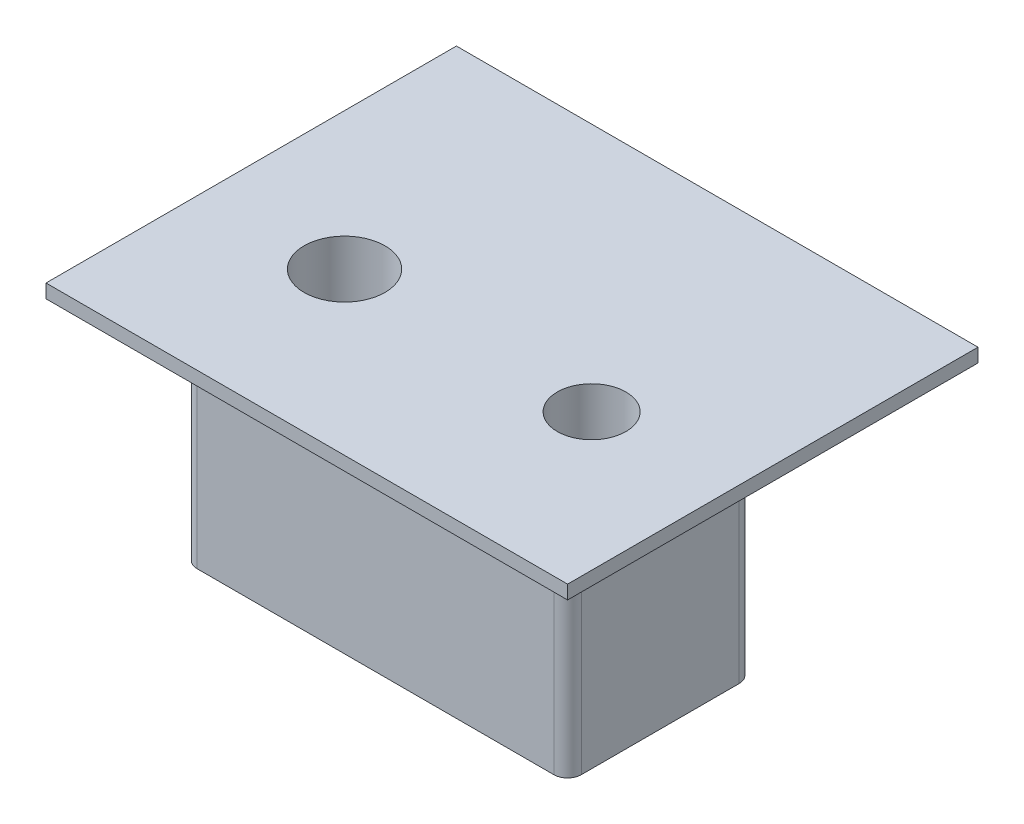
ISO-10303-21;
HEADER;
FILE_DESCRIPTION(('STEP AP214'),'2;1');
FILE_NAME('part.step','',(''),(''),'','','');
FILE_SCHEMA(('AUTOMOTIVE_DESIGN { 1 0 10303 214 1 1 1 1 }'));
ENDSEC;
DATA;
#1=APPLICATION_CONTEXT('core data for automotive mechanical design processes');
#2=APPLICATION_PROTOCOL_DEFINITION('international standard','automotive_design',2000,#1);
#3=PRODUCT_CONTEXT('',#1,'mechanical');
#4=PRODUCT('Part','Part','',(#3));
#5=PRODUCT_RELATED_PRODUCT_CATEGORY('part','',(#4));
#6=PRODUCT_DEFINITION_FORMATION('','',#4);
#7=PRODUCT_DEFINITION_CONTEXT('part definition',#1,'design');
#8=PRODUCT_DEFINITION('design','',#6,#7);
#9=PRODUCT_DEFINITION_SHAPE('','',#8);
#10=(LENGTH_UNIT() NAMED_UNIT(*) SI_UNIT(.MILLI.,.METRE.));
#11=(NAMED_UNIT(*) PLANE_ANGLE_UNIT() SI_UNIT($,.RADIAN.));
#12=(NAMED_UNIT(*) SI_UNIT($,.STERADIAN.) SOLID_ANGLE_UNIT());
#13=UNCERTAINTY_MEASURE_WITH_UNIT(LENGTH_MEASURE(1.E-05),#10,'distance_accuracy_value','');
#14=(GEOMETRIC_REPRESENTATION_CONTEXT(3) GLOBAL_UNCERTAINTY_ASSIGNED_CONTEXT((#13)) GLOBAL_UNIT_ASSIGNED_CONTEXT((#10,
#11,#12)) REPRESENTATION_CONTEXT('',''));
#15=CARTESIAN_POINT('',(0.,0.,0.));
#16=DIRECTION('',(0.,0.,1.));
#17=DIRECTION('',(1.,0.,0.));
#18=AXIS2_PLACEMENT_3D('',#15,#16,#17);
#19=CARTESIAN_POINT('',(-7.,185.,3.375));
#20=DIRECTION('',(0.,1.,0.));
#21=DIRECTION('',(0.,0.,1.));
#22=AXIS2_PLACEMENT_3D('',#19,#20,#21);
#23=PLANE('',#22);
#24=DIRECTION('',(1.,0.,0.));
#25=VECTOR('',#24,1.);
#26=CARTESIAN_POINT('',(-7.,185.,-3.375));
#27=LINE('',#26,#25);
#28=CARTESIAN_POINT('',(-6.5,185.,-3.375));
#29=VERTEX_POINT('',#28);
#30=CARTESIAN_POINT('',(6.5,185.,-3.375));
#31=VERTEX_POINT('',#30);
#32=EDGE_CURVE('E170',#29,#31,#27,.T.);
#33=ORIENTED_EDGE('',*,*,#32,.T.);
#34=CARTESIAN_POINT('',(6.5,185.,-2.875));
#35=DIRECTION('',(0.,1.,0.));
#36=DIRECTION('',(0.,0.,1.));
#37=AXIS2_PLACEMENT_3D('',#34,#35,#36);
#38=CIRCLE('',#37,0.5);
#39=CARTESIAN_POINT('',(7.,185.,-2.875));
#40=VERTEX_POINT('',#39);
#41=EDGE_CURVE('E211',#31,#40,#38,.F.);
#42=ORIENTED_EDGE('',*,*,#41,.T.);
#43=DIRECTION('',(0.,0.,-1.));
#44=VECTOR('',#43,1.);
#45=CARTESIAN_POINT('',(7.,185.,3.375));
#46=LINE('',#45,#44);
#47=CARTESIAN_POINT('',(7.,185.,2.875));
#48=VERTEX_POINT('',#47);
#49=EDGE_CURVE('E186',#48,#40,#46,.T.);
#50=ORIENTED_EDGE('',*,*,#49,.F.);
#51=CARTESIAN_POINT('',(6.5,185.,2.875));
#52=DIRECTION('',(0.,1.,0.));
#53=DIRECTION('',(0.,0.,1.));
#54=AXIS2_PLACEMENT_3D('',#51,#52,#53);
#55=CIRCLE('',#54,0.5);
#56=CARTESIAN_POINT('',(6.5,185.,3.375));
#57=VERTEX_POINT('',#56);
#58=EDGE_CURVE('E209',#48,#57,#55,.F.);
#59=ORIENTED_EDGE('',*,*,#58,.T.);
#60=DIRECTION('',(1.,0.,0.));
#61=VECTOR('',#60,1.);
#62=CARTESIAN_POINT('',(-7.,185.,3.375));
#63=LINE('',#62,#61);
#64=CARTESIAN_POINT('',(-6.5,185.,3.375));
#65=VERTEX_POINT('',#64);
#66=EDGE_CURVE('E171',#65,#57,#63,.T.);
#67=ORIENTED_EDGE('',*,*,#66,.F.);
#68=CARTESIAN_POINT('',(-6.5,185.,2.875));
#69=DIRECTION('',(0.,1.,0.));
#70=DIRECTION('',(0.,0.,1.));
#71=AXIS2_PLACEMENT_3D('',#68,#69,#70);
#72=CIRCLE('',#71,0.5);
#73=CARTESIAN_POINT('',(-7.,185.,2.875));
#74=VERTEX_POINT('',#73);
#75=EDGE_CURVE('E205',#65,#74,#72,.F.);
#76=ORIENTED_EDGE('',*,*,#75,.T.);
#77=DIRECTION('',(0.,0.,-1.));
#78=VECTOR('',#77,1.);
#79=CARTESIAN_POINT('',(-7.,185.,3.375));
#80=LINE('',#79,#78);
#81=CARTESIAN_POINT('',(-7.,185.,-2.875));
#82=VERTEX_POINT('',#81);
#83=EDGE_CURVE('E189',#74,#82,#80,.T.);
#84=ORIENTED_EDGE('',*,*,#83,.T.);
#85=CARTESIAN_POINT('',(-6.5,185.,-2.875));
#86=DIRECTION('',(0.,1.,0.));
#87=DIRECTION('',(0.,0.,1.));
#88=AXIS2_PLACEMENT_3D('',#85,#86,#87);
#89=CIRCLE('',#88,0.5);
#90=EDGE_CURVE('E207',#82,#29,#89,.F.);
#91=ORIENTED_EDGE('',*,*,#90,.T.);
#92=EDGE_LOOP('',(#33,#42,#50,#59,#67,#76,#84,#91));
#93=FACE_BOUND('',#92,.T.);
#94=CARTESIAN_POINT('',(-4.49999999999999,185.,0.));
#95=DIRECTION('',(0.,1.,0.));
#96=DIRECTION('',(0.,0.,1.));
#97=AXIS2_PLACEMENT_3D('',#94,#95,#96);
#98=CIRCLE('',#97,1.4732);
#99=CARTESIAN_POINT('',(-4.49999999999999,185.,1.4732));
#100=VERTEX_POINT('',#99);
#101=EDGE_CURVE('E132',#100,#100,#98,.T.);
#102=ORIENTED_EDGE('',*,*,#101,.T.);
#103=EDGE_LOOP('',(#102));
#104=FACE_BOUND('',#103,.T.);
#105=CARTESIAN_POINT('',(4.5,185.,0.));
#106=DIRECTION('',(0.,1.,0.));
#107=DIRECTION('',(0.,0.,1.));
#108=AXIS2_PLACEMENT_3D('',#105,#106,#107);
#109=CIRCLE('',#108,1.25);
#110=CARTESIAN_POINT('',(4.5,185.,1.25));
#111=VERTEX_POINT('',#110);
#112=EDGE_CURVE('E151',#111,#111,#109,.F.);
#113=ORIENTED_EDGE('',*,*,#112,.F.);
#114=EDGE_LOOP('',(#113));
#115=FACE_BOUND('',#114,.T.);
#116=ADVANCED_FACE('F31',(#93,#104,#115),#23,.F.);
#117=CARTESIAN_POINT('',(9.5,193.7625,-5.875));
#118=DIRECTION('',(0.,1.,0.));
#119=DIRECTION('',(0.,0.,1.));
#120=AXIS2_PLACEMENT_3D('',#117,#118,#119);
#121=PLANE('',#120);
#122=DIRECTION('',(0.,0.,-1.));
#123=VECTOR('',#122,1.);
#124=CARTESIAN_POINT('',(9.5,193.7625,5.875));
#125=LINE('',#124,#123);
#126=CARTESIAN_POINT('',(9.5,193.7625,5.875));
#127=VERTEX_POINT('',#126);
#128=CARTESIAN_POINT('',(9.5,193.7625,-9.075));
#129=VERTEX_POINT('',#128);
#130=EDGE_CURVE('E157',#127,#129,#125,.T.);
#131=ORIENTED_EDGE('',*,*,#130,.T.);
#132=DIRECTION('',(1.,0.,0.));
#133=VECTOR('',#132,1.);
#134=CARTESIAN_POINT('',(-9.5,193.7625,-9.075));
#135=LINE('',#134,#133);
#136=CARTESIAN_POINT('',(-9.5,193.7625,-9.075));
#137=VERTEX_POINT('',#136);
#138=EDGE_CURVE('E145',#137,#129,#135,.T.);
#139=ORIENTED_EDGE('',*,*,#138,.F.);
#140=DIRECTION('',(0.,0.,1.));
#141=VECTOR('',#140,1.);
#142=CARTESIAN_POINT('',(-9.5,193.7625,-5.875));
#143=LINE('',#142,#141);
#144=CARTESIAN_POINT('',(-9.5,193.7625,5.875));
#145=VERTEX_POINT('',#144);
#146=EDGE_CURVE('E159',#137,#145,#143,.T.);
#147=ORIENTED_EDGE('',*,*,#146,.T.);
#148=DIRECTION('',(1.,0.,0.));
#149=VECTOR('',#148,1.);
#150=CARTESIAN_POINT('',(-9.5,193.7625,5.875));
#151=LINE('',#150,#149);
#152=EDGE_CURVE('E162',#145,#127,#151,.T.);
#153=ORIENTED_EDGE('',*,*,#152,.T.);
#154=EDGE_LOOP('',(#131,#139,#147,#153));
#155=FACE_BOUND('',#154,.T.);
#156=CARTESIAN_POINT('',(-4.49999999999999,193.7625,0.));
#157=DIRECTION('',(0.,1.,0.));
#158=DIRECTION('',(0.,0.,1.));
#159=AXIS2_PLACEMENT_3D('',#156,#157,#158);
#160=CIRCLE('',#159,1.4732);
#161=CARTESIAN_POINT('',(-4.49999999999999,193.7625,1.4732));
#162=VERTEX_POINT('',#161);
#163=EDGE_CURVE('E154',#162,#162,#160,.T.);
#164=ORIENTED_EDGE('',*,*,#163,.F.);
#165=EDGE_LOOP('',(#164));
#166=FACE_BOUND('',#165,.T.);
#167=CARTESIAN_POINT('',(4.5,193.7625,0.));
#168=DIRECTION('',(0.,1.,0.));
#169=DIRECTION('',(0.,0.,1.));
#170=AXIS2_PLACEMENT_3D('',#167,#168,#169);
#171=CIRCLE('',#170,1.25);
#172=CARTESIAN_POINT('',(4.5,193.7625,1.25));
#173=VERTEX_POINT('',#172);
#174=EDGE_CURVE('E150',#173,#173,#171,.F.);
#175=ORIENTED_EDGE('',*,*,#174,.T.);
#176=EDGE_LOOP('',(#175));
#177=FACE_BOUND('',#176,.T.);
#178=ADVANCED_FACE('F271',(#155,#166,#177),#121,.T.);
#179=CARTESIAN_POINT('',(-7.,193.2625,3.375));
#180=DIRECTION('',(1.,0.,0.));
#181=DIRECTION('',(0.,1.,0.));
#182=AXIS2_PLACEMENT_3D('',#179,#180,#181);
#183=PLANE('',#182);
#184=DIRECTION('',(0.,0.,-1.));
#185=VECTOR('',#184,1.);
#186=CARTESIAN_POINT('',(-7.,193.2625,3.375));
#187=LINE('',#186,#185);
#188=CARTESIAN_POINT('',(-7.,193.2625,2.875));
#189=VERTEX_POINT('',#188);
#190=CARTESIAN_POINT('',(-7.,193.2625,-2.875));
#191=VERTEX_POINT('',#190);
#192=EDGE_CURVE('E178',#189,#191,#187,.T.);
#193=ORIENTED_EDGE('',*,*,#192,.T.);
#194=DIRECTION('',(0.,-1.,0.));
#195=VECTOR('',#194,1.);
#196=CARTESIAN_POINT('',(-7.,193.2625,-2.875));
#197=LINE('',#196,#195);
#198=EDGE_CURVE('E220',#191,#82,#197,.T.);
#199=ORIENTED_EDGE('',*,*,#198,.T.);
#200=ORIENTED_EDGE('',*,*,#83,.F.);
#201=DIRECTION('',(0.,-1.,0.));
#202=VECTOR('',#201,1.);
#203=CARTESIAN_POINT('',(-7.,193.2625,2.875));
#204=LINE('',#203,#202);
#205=EDGE_CURVE('E52',#74,#189,#204,.F.);
#206=ORIENTED_EDGE('',*,*,#205,.T.);
#207=EDGE_LOOP('',(#193,#199,#200,#206));
#208=FACE_BOUND('',#207,.T.);
#209=ADVANCED_FACE('F245',(#208),#183,.F.);
#210=CARTESIAN_POINT('',(7.,193.2625,3.375));
#211=DIRECTION('',(-1.,0.,0.));
#212=DIRECTION('',(0.,-1.,0.));
#213=AXIS2_PLACEMENT_3D('',#210,#211,#212);
#214=PLANE('',#213);
#215=ORIENTED_EDGE('',*,*,#49,.T.);
#216=DIRECTION('',(0.,1.,0.));
#217=VECTOR('',#216,1.);
#218=CARTESIAN_POINT('',(7.,193.2625,-2.875));
#219=LINE('',#218,#217);
#220=CARTESIAN_POINT('',(7.,193.2625,-2.875));
#221=VERTEX_POINT('',#220);
#222=EDGE_CURVE('E198',#40,#221,#219,.T.);
#223=ORIENTED_EDGE('',*,*,#222,.T.);
#224=DIRECTION('',(0.,0.,-1.));
#225=VECTOR('',#224,1.);
#226=CARTESIAN_POINT('',(7.,193.2625,3.375));
#227=LINE('',#226,#225);
#228=CARTESIAN_POINT('',(7.,193.2625,2.875));
#229=VERTEX_POINT('',#228);
#230=EDGE_CURVE('E183',#229,#221,#227,.T.);
#231=ORIENTED_EDGE('',*,*,#230,.F.);
#232=DIRECTION('',(0.,1.,0.));
#233=VECTOR('',#232,1.);
#234=CARTESIAN_POINT('',(7.,185.,2.875));
#235=LINE('',#234,#233);
#236=EDGE_CURVE('E192',#229,#48,#235,.F.);
#237=ORIENTED_EDGE('',*,*,#236,.T.);
#238=EDGE_LOOP('',(#215,#223,#231,#237));
#239=FACE_BOUND('',#238,.T.);
#240=ADVANCED_FACE('F232',(#239),#214,.F.);
#241=CARTESIAN_POINT('',(-7.,185.,3.375));
#242=DIRECTION('',(0.,0.,1.));
#243=DIRECTION('',(1.,0.,0.));
#244=AXIS2_PLACEMENT_3D('',#241,#242,#243);
#245=PLANE('',#244);
#246=ORIENTED_EDGE('',*,*,#66,.T.);
#247=DIRECTION('',(0.,1.,0.));
#248=VECTOR('',#247,1.);
#249=CARTESIAN_POINT('',(6.5,193.2625,3.375));
#250=LINE('',#249,#248);
#251=CARTESIAN_POINT('',(6.5,193.2625,3.375));
#252=VERTEX_POINT('',#251);
#253=EDGE_CURVE('E216',#57,#252,#250,.T.);
#254=ORIENTED_EDGE('',*,*,#253,.T.);
#255=DIRECTION('',(-1.,0.,0.));
#256=VECTOR('',#255,1.);
#257=CARTESIAN_POINT('',(-7.,193.2625,3.375));
#258=LINE('',#257,#256);
#259=CARTESIAN_POINT('',(-6.5,193.2625,3.375));
#260=VERTEX_POINT('',#259);
#261=EDGE_CURVE('E174',#252,#260,#258,.T.);
#262=ORIENTED_EDGE('',*,*,#261,.T.);
#263=DIRECTION('',(0.,-1.,0.));
#264=VECTOR('',#263,1.);
#265=CARTESIAN_POINT('',(-6.5,185.,3.375));
#266=LINE('',#265,#264);
#267=EDGE_CURVE('E213',#260,#65,#266,.T.);
#268=ORIENTED_EDGE('',*,*,#267,.T.);
#269=EDGE_LOOP('',(#246,#254,#262,#268));
#270=FACE_BOUND('',#269,.T.);
#271=ADVANCED_FACE('F241',(#270),#245,.T.);
#272=CARTESIAN_POINT('',(-7.,185.,-3.375));
#273=DIRECTION('',(0.,0.,1.));
#274=DIRECTION('',(1.,0.,0.));
#275=AXIS2_PLACEMENT_3D('',#272,#273,#274);
#276=PLANE('',#275);
#277=DIRECTION('',(-1.,0.,0.));
#278=VECTOR('',#277,1.);
#279=CARTESIAN_POINT('',(-7.,193.2625,-3.375));
#280=LINE('',#279,#278);
#281=CARTESIAN_POINT('',(6.5,193.2625,-3.375));
#282=VERTEX_POINT('',#281);
#283=CARTESIAN_POINT('',(-6.5,193.2625,-3.375));
#284=VERTEX_POINT('',#283);
#285=EDGE_CURVE('E175',#282,#284,#280,.T.);
#286=ORIENTED_EDGE('',*,*,#285,.F.);
#287=DIRECTION('',(0.,1.,0.));
#288=VECTOR('',#287,1.);
#289=CARTESIAN_POINT('',(6.5,185.,-3.375));
#290=LINE('',#289,#288);
#291=EDGE_CURVE('E203',#282,#31,#290,.F.);
#292=ORIENTED_EDGE('',*,*,#291,.T.);
#293=ORIENTED_EDGE('',*,*,#32,.F.);
#294=DIRECTION('',(0.,-1.,0.));
#295=VECTOR('',#294,1.);
#296=CARTESIAN_POINT('',(-6.5,185.,-3.375));
#297=LINE('',#296,#295);
#298=EDGE_CURVE('E201',#29,#284,#297,.F.);
#299=ORIENTED_EDGE('',*,*,#298,.T.);
#300=EDGE_LOOP('',(#286,#292,#293,#299));
#301=FACE_BOUND('',#300,.T.);
#302=ADVANCED_FACE('F254',(#301),#276,.F.);
#303=CARTESIAN_POINT('',(9.5,193.7625,5.875));
#304=DIRECTION('',(-1.,0.,0.));
#305=DIRECTION('',(0.,0.,1.));
#306=AXIS2_PLACEMENT_3D('',#303,#304,#305);
#307=PLANE('',#306);
#308=DIRECTION('',(0.,0.,-1.));
#309=VECTOR('',#308,1.);
#310=CARTESIAN_POINT('',(9.5,193.2625,5.875));
#311=LINE('',#310,#309);
#312=CARTESIAN_POINT('',(9.5,193.2625,5.875));
#313=VERTEX_POINT('',#312);
#314=CARTESIAN_POINT('',(9.5,193.2625,-9.075));
#315=VERTEX_POINT('',#314);
#316=EDGE_CURVE('E121',#313,#315,#311,.T.);
#317=ORIENTED_EDGE('',*,*,#316,.T.);
#318=DIRECTION('',(0.,-1.,0.));
#319=VECTOR('',#318,1.);
#320=CARTESIAN_POINT('',(9.5,193.7625,-9.075));
#321=LINE('',#320,#319);
#322=EDGE_CURVE('E126',#129,#315,#321,.T.);
#323=ORIENTED_EDGE('',*,*,#322,.F.);
#324=ORIENTED_EDGE('',*,*,#130,.F.);
#325=DIRECTION('',(0.,-1.,0.));
#326=VECTOR('',#325,1.);
#327=CARTESIAN_POINT('',(9.5,193.7625,5.875));
#328=LINE('',#327,#326);
#329=EDGE_CURVE('E128',#127,#313,#328,.T.);
#330=ORIENTED_EDGE('',*,*,#329,.T.);
#331=EDGE_LOOP('',(#317,#323,#324,#330));
#332=FACE_BOUND('',#331,.T.);
#333=ADVANCED_FACE('F123',(#332),#307,.F.);
#334=CARTESIAN_POINT('',(-9.5,193.7625,-5.875));
#335=DIRECTION('',(1.,0.,0.));
#336=DIRECTION('',(0.,0.,-1.));
#337=AXIS2_PLACEMENT_3D('',#334,#335,#336);
#338=PLANE('',#337);
#339=DIRECTION('',(0.,0.,1.));
#340=VECTOR('',#339,1.);
#341=CARTESIAN_POINT('',(-9.5,193.2625,-5.875));
#342=LINE('',#341,#340);
#343=CARTESIAN_POINT('',(-9.5,193.2625,-9.075));
#344=VERTEX_POINT('',#343);
#345=CARTESIAN_POINT('',(-9.5,193.2625,5.875));
#346=VERTEX_POINT('',#345);
#347=EDGE_CURVE('E131',#344,#346,#342,.T.);
#348=ORIENTED_EDGE('',*,*,#347,.T.);
#349=DIRECTION('',(0.,-1.,0.));
#350=VECTOR('',#349,1.);
#351=CARTESIAN_POINT('',(-9.5,193.7625,5.875));
#352=LINE('',#351,#350);
#353=EDGE_CURVE('E167',#145,#346,#352,.T.);
#354=ORIENTED_EDGE('',*,*,#353,.F.);
#355=ORIENTED_EDGE('',*,*,#146,.F.);
#356=DIRECTION('',(0.,1.,0.));
#357=VECTOR('',#356,1.);
#358=CARTESIAN_POINT('',(-9.5,193.2625,-9.075));
#359=LINE('',#358,#357);
#360=EDGE_CURVE('E140',#344,#137,#359,.T.);
#361=ORIENTED_EDGE('',*,*,#360,.F.);
#362=EDGE_LOOP('',(#348,#354,#355,#361));
#363=FACE_BOUND('',#362,.T.);
#364=ADVANCED_FACE('F294',(#363),#338,.F.);
#365=CARTESIAN_POINT('',(-9.5,193.7625,5.875));
#366=DIRECTION('',(0.,0.,-1.));
#367=DIRECTION('',(-1.,0.,0.));
#368=AXIS2_PLACEMENT_3D('',#365,#366,#367);
#369=PLANE('',#368);
#370=DIRECTION('',(1.,0.,0.));
#371=VECTOR('',#370,1.);
#372=CARTESIAN_POINT('',(-9.5,193.2625,5.875));
#373=LINE('',#372,#371);
#374=EDGE_CURVE('E160',#346,#313,#373,.T.);
#375=ORIENTED_EDGE('',*,*,#374,.T.);
#376=ORIENTED_EDGE('',*,*,#329,.F.);
#377=ORIENTED_EDGE('',*,*,#152,.F.);
#378=ORIENTED_EDGE('',*,*,#353,.T.);
#379=EDGE_LOOP('',(#375,#376,#377,#378));
#380=FACE_BOUND('',#379,.T.);
#381=ADVANCED_FACE('F297',(#380),#369,.F.);
#382=CARTESIAN_POINT('',(9.5,193.2625,-5.875));
#383=DIRECTION('',(0.,1.,0.));
#384=DIRECTION('',(0.,0.,1.));
#385=AXIS2_PLACEMENT_3D('',#382,#383,#384);
#386=PLANE('',#385);
#387=ORIENTED_EDGE('',*,*,#261,.F.);
#388=CARTESIAN_POINT('',(6.5,193.2625,2.875));
#389=DIRECTION('',(0.,1.,0.));
#390=DIRECTION('',(0.,0.,1.));
#391=AXIS2_PLACEMENT_3D('',#388,#389,#390);
#392=CIRCLE('',#391,0.5);
#393=EDGE_CURVE('E225',#252,#229,#392,.T.);
#394=ORIENTED_EDGE('',*,*,#393,.T.);
#395=ORIENTED_EDGE('',*,*,#230,.T.);
#396=CARTESIAN_POINT('',(6.5,193.2625,-2.875));
#397=DIRECTION('',(0.,1.,0.));
#398=DIRECTION('',(0.,0.,1.));
#399=AXIS2_PLACEMENT_3D('',#396,#397,#398);
#400=CIRCLE('',#399,0.5);
#401=EDGE_CURVE('E223',#221,#282,#400,.T.);
#402=ORIENTED_EDGE('',*,*,#401,.T.);
#403=ORIENTED_EDGE('',*,*,#285,.T.);
#404=CARTESIAN_POINT('',(-6.5,193.2625,-2.875));
#405=DIRECTION('',(0.,1.,0.));
#406=DIRECTION('',(0.,0.,1.));
#407=AXIS2_PLACEMENT_3D('',#404,#405,#406);
#408=CIRCLE('',#407,0.5);
#409=EDGE_CURVE('E39',#284,#191,#408,.T.);
#410=ORIENTED_EDGE('',*,*,#409,.T.);
#411=ORIENTED_EDGE('',*,*,#192,.F.);
#412=CARTESIAN_POINT('',(-6.5,193.2625,2.875));
#413=DIRECTION('',(0.,1.,0.));
#414=DIRECTION('',(0.,0.,1.));
#415=AXIS2_PLACEMENT_3D('',#412,#413,#414);
#416=CIRCLE('',#415,0.5);
#417=EDGE_CURVE('E11',#189,#260,#416,.T.);
#418=ORIENTED_EDGE('',*,*,#417,.T.);
#419=EDGE_LOOP('',(#387,#394,#395,#402,#403,#410,#411,#418));
#420=FACE_BOUND('',#419,.T.);
#421=ORIENTED_EDGE('',*,*,#316,.F.);
#422=ORIENTED_EDGE('',*,*,#374,.F.);
#423=ORIENTED_EDGE('',*,*,#347,.F.);
#424=DIRECTION('',(-1.,0.,0.));
#425=VECTOR('',#424,1.);
#426=CARTESIAN_POINT('',(9.5,193.2625,-9.075));
#427=LINE('',#426,#425);
#428=EDGE_CURVE('E135',#315,#344,#427,.T.);
#429=ORIENTED_EDGE('',*,*,#428,.F.);
#430=EDGE_LOOP('',(#421,#422,#423,#429));
#431=FACE_BOUND('',#430,.T.);
#432=ADVANCED_FACE('F136',(#420,#431),#386,.F.);
#433=CARTESIAN_POINT('',(-4.49999999999999,202.803113019111,0.));
#434=DIRECTION('',(0.,1.,0.));
#435=DIRECTION('',(0.,0.,1.));
#436=AXIS2_PLACEMENT_3D('',#433,#434,#435);
#437=CYLINDRICAL_SURFACE('',#436,1.4732);
#438=ORIENTED_EDGE('',*,*,#163,.T.);
#439=EDGE_LOOP('',(#438));
#440=FACE_BOUND('',#439,.T.);
#441=ORIENTED_EDGE('',*,*,#101,.F.);
#442=EDGE_LOOP('',(#441));
#443=FACE_BOUND('',#442,.T.);
#444=ADVANCED_FACE('F266',(#440,#443),#437,.F.);
#445=CARTESIAN_POINT('',(4.5,219.496854938699,0.));
#446=DIRECTION('',(0.,1.,0.));
#447=DIRECTION('',(-1.,0.,0.));
#448=AXIS2_PLACEMENT_3D('',#445,#446,#447);
#449=CYLINDRICAL_SURFACE('',#448,1.25);
#450=ORIENTED_EDGE('',*,*,#174,.F.);
#451=EDGE_LOOP('',(#450));
#452=FACE_BOUND('',#451,.T.);
#453=ORIENTED_EDGE('',*,*,#112,.T.);
#454=EDGE_LOOP('',(#453));
#455=FACE_BOUND('',#454,.T.);
#456=ADVANCED_FACE('F259',(#452,#455),#449,.F.);
#457=CARTESIAN_POINT('',(6.5,193.2625,-2.875));
#458=DIRECTION('',(0.,1.,0.));
#459=DIRECTION('',(-1.,0.,0.));
#460=AXIS2_PLACEMENT_3D('',#457,#458,#459);
#461=CYLINDRICAL_SURFACE('',#460,0.5);
#462=ORIENTED_EDGE('',*,*,#41,.F.);
#463=ORIENTED_EDGE('',*,*,#291,.F.);
#464=ORIENTED_EDGE('',*,*,#401,.F.);
#465=ORIENTED_EDGE('',*,*,#222,.F.);
#466=EDGE_LOOP('',(#462,#463,#464,#465));
#467=FACE_BOUND('',#466,.T.);
#468=ADVANCED_FACE('F257',(#467),#461,.T.);
#469=CARTESIAN_POINT('',(6.5,185.,2.875));
#470=DIRECTION('',(0.,-1.,0.));
#471=DIRECTION('',(1.,0.,0.));
#472=AXIS2_PLACEMENT_3D('',#469,#470,#471);
#473=CYLINDRICAL_SURFACE('',#472,0.5);
#474=ORIENTED_EDGE('',*,*,#58,.F.);
#475=ORIENTED_EDGE('',*,*,#236,.F.);
#476=ORIENTED_EDGE('',*,*,#393,.F.);
#477=ORIENTED_EDGE('',*,*,#253,.F.);
#478=EDGE_LOOP('',(#474,#475,#476,#477));
#479=FACE_BOUND('',#478,.T.);
#480=ADVANCED_FACE('F236',(#479),#473,.T.);
#481=CARTESIAN_POINT('',(-6.5,193.2625,-2.875));
#482=DIRECTION('',(0.,-1.,0.));
#483=DIRECTION('',(1.,0.,0.));
#484=AXIS2_PLACEMENT_3D('',#481,#482,#483);
#485=CYLINDRICAL_SURFACE('',#484,0.5);
#486=ORIENTED_EDGE('',*,*,#409,.F.);
#487=ORIENTED_EDGE('',*,*,#298,.F.);
#488=ORIENTED_EDGE('',*,*,#90,.F.);
#489=ORIENTED_EDGE('',*,*,#198,.F.);
#490=EDGE_LOOP('',(#486,#487,#488,#489));
#491=FACE_BOUND('',#490,.T.);
#492=ADVANCED_FACE('F248',(#491),#485,.T.);
#493=CARTESIAN_POINT('',(-6.5,185.,2.875));
#494=DIRECTION('',(0.,1.,0.));
#495=DIRECTION('',(-1.,0.,0.));
#496=AXIS2_PLACEMENT_3D('',#493,#494,#495);
#497=CYLINDRICAL_SURFACE('',#496,0.5);
#498=ORIENTED_EDGE('',*,*,#417,.F.);
#499=ORIENTED_EDGE('',*,*,#205,.F.);
#500=ORIENTED_EDGE('',*,*,#75,.F.);
#501=ORIENTED_EDGE('',*,*,#267,.F.);
#502=EDGE_LOOP('',(#498,#499,#500,#501));
#503=FACE_BOUND('',#502,.T.);
#504=ADVANCED_FACE('F33',(#503),#497,.T.);
#505=CARTESIAN_POINT('',(9.5,193.2625,-9.075));
#506=DIRECTION('',(0.,0.,-1.));
#507=DIRECTION('',(-1.,0.,0.));
#508=AXIS2_PLACEMENT_3D('',#505,#506,#507);
#509=PLANE('',#508);
#510=ORIENTED_EDGE('',*,*,#322,.T.);
#511=ORIENTED_EDGE('',*,*,#428,.T.);
#512=ORIENTED_EDGE('',*,*,#360,.T.);
#513=ORIENTED_EDGE('',*,*,#138,.T.);
#514=EDGE_LOOP('',(#510,#511,#512,#513));
#515=FACE_BOUND('',#514,.T.);
#516=ADVANCED_FACE('F143',(#515),#509,.T.);
#517=CLOSED_SHELL('',(#116,#178,#209,#240,#271,#302,#333,#364,#381,#432,#444,#456,#468,#480,
#492,#504,#516));
#518=MANIFOLD_SOLID_BREP('B2',#517);
#519=ADVANCED_BREP_SHAPE_REPRESENTATION('',(#18,#518),#14);
#520=SHAPE_DEFINITION_REPRESENTATION(#9,#519);
ENDSEC;
END-ISO-10303-21;
